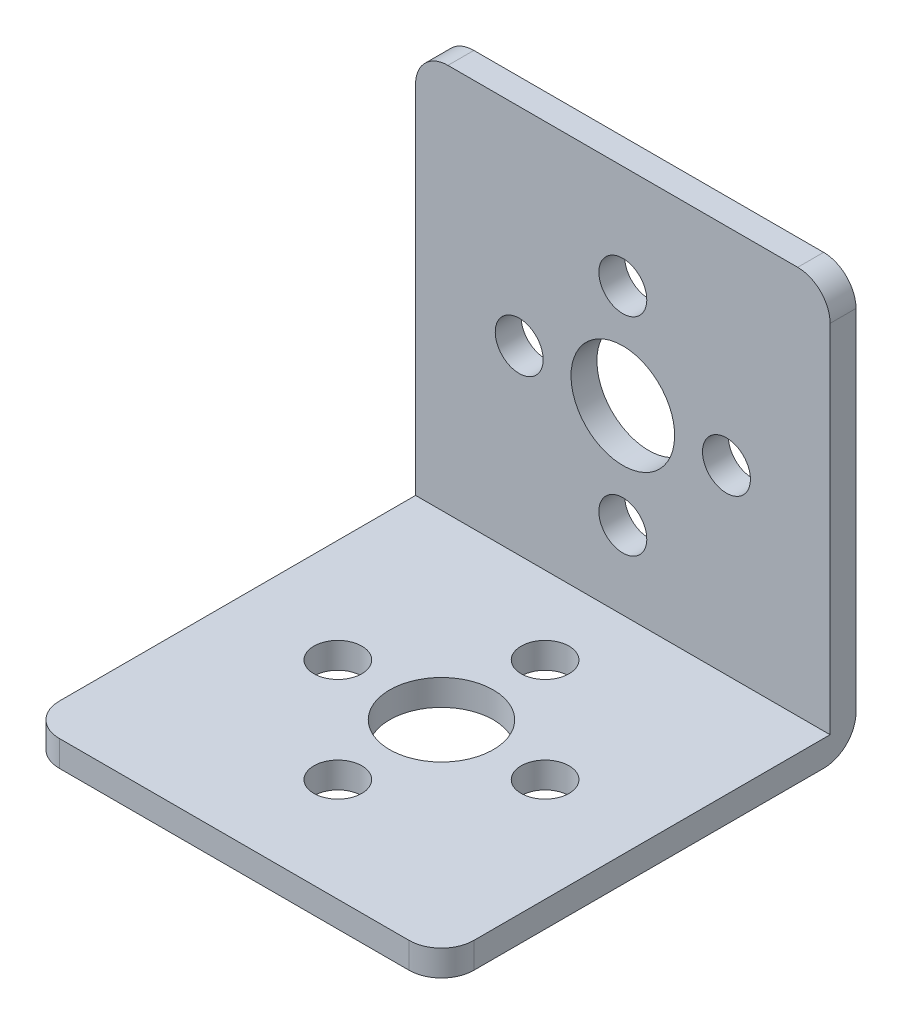
ISO-10303-21;
HEADER;
FILE_DESCRIPTION(('STEP AP214'),'2;1');
FILE_NAME('part.step','',(''),(''),'','','');
FILE_SCHEMA(('AUTOMOTIVE_DESIGN { 1 0 10303 214 1 1 1 1 }'));
ENDSEC;
DATA;
#1=APPLICATION_CONTEXT('core data for automotive mechanical design processes');
#2=APPLICATION_PROTOCOL_DEFINITION('international standard','automotive_design',2000,#1);
#3=PRODUCT_CONTEXT('',#1,'mechanical');
#4=PRODUCT('Part','Part','',(#3));
#5=PRODUCT_RELATED_PRODUCT_CATEGORY('part','',(#4));
#6=PRODUCT_DEFINITION_FORMATION('','',#4);
#7=PRODUCT_DEFINITION_CONTEXT('part definition',#1,'design');
#8=PRODUCT_DEFINITION('design','',#6,#7);
#9=PRODUCT_DEFINITION_SHAPE('','',#8);
#10=(LENGTH_UNIT() NAMED_UNIT(*) SI_UNIT(.MILLI.,.METRE.));
#11=(NAMED_UNIT(*) PLANE_ANGLE_UNIT() SI_UNIT($,.RADIAN.));
#12=(NAMED_UNIT(*) SI_UNIT($,.STERADIAN.) SOLID_ANGLE_UNIT());
#13=UNCERTAINTY_MEASURE_WITH_UNIT(LENGTH_MEASURE(1.E-05),#10,'distance_accuracy_value','');
#14=(GEOMETRIC_REPRESENTATION_CONTEXT(3) GLOBAL_UNCERTAINTY_ASSIGNED_CONTEXT((#13)) GLOBAL_UNIT_ASSIGNED_CONTEXT((#10,
#11,#12)) REPRESENTATION_CONTEXT('',''));
#15=CARTESIAN_POINT('',(0.,0.,0.));
#16=DIRECTION('',(0.,0.,1.));
#17=DIRECTION('',(1.,0.,0.));
#18=AXIS2_PLACEMENT_3D('',#15,#16,#17);
#19=CARTESIAN_POINT('',(16.,16.,16.));
#20=DIRECTION('',(0.,-1.,0.));
#21=DIRECTION('',(0.,0.,-1.));
#22=AXIS2_PLACEMENT_3D('',#19,#20,#21);
#23=PLANE('',#22);
#24=DIRECTION('',(1.,0.,0.));
#25=VECTOR('',#24,1.);
#26=CARTESIAN_POINT('',(-16.,16.,-14.));
#27=LINE('',#26,#25);
#28=CARTESIAN_POINT('',(-13.5,16.,-14.));
#29=VERTEX_POINT('',#28);
#30=CARTESIAN_POINT('',(13.5,16.,-14.));
#31=VERTEX_POINT('',#30);
#32=EDGE_CURVE('E193',#29,#31,#27,.T.);
#33=ORIENTED_EDGE('',*,*,#32,.T.);
#34=DIRECTION('',(0.,0.,-1.));
#35=VECTOR('',#34,1.);
#36=CARTESIAN_POINT('',(13.5,16.,-16.));
#37=LINE('',#36,#35);
#38=CARTESIAN_POINT('',(13.5,16.,-16.));
#39=VERTEX_POINT('',#38);
#40=EDGE_CURVE('E114',#39,#31,#37,.F.);
#41=ORIENTED_EDGE('',*,*,#40,.F.);
#42=DIRECTION('',(1.,0.,0.));
#43=VECTOR('',#42,1.);
#44=CARTESIAN_POINT('',(16.,16.,-16.));
#45=LINE('',#44,#43);
#46=CARTESIAN_POINT('',(-13.5,16.,-16.));
#47=VERTEX_POINT('',#46);
#48=EDGE_CURVE('E103',#39,#47,#45,.F.);
#49=ORIENTED_EDGE('',*,*,#48,.T.);
#50=DIRECTION('',(0.,0.,1.));
#51=VECTOR('',#50,1.);
#52=CARTESIAN_POINT('',(-13.5,16.,16.));
#53=LINE('',#52,#51);
#54=EDGE_CURVE('E94',#29,#47,#53,.F.);
#55=ORIENTED_EDGE('',*,*,#54,.F.);
#56=EDGE_LOOP('',(#33,#41,#49,#55));
#57=FACE_BOUND('',#56,.T.);
#58=ADVANCED_FACE('F15',(#57),#23,.F.);
#59=CARTESIAN_POINT('',(-13.5,13.5,16.));
#60=DIRECTION('',(0.,0.,1.));
#61=DIRECTION('',(1.,0.,0.));
#62=AXIS2_PLACEMENT_3D('',#59,#60,#61);
#63=CYLINDRICAL_SURFACE('',#62,2.5);
#64=ORIENTED_EDGE('',*,*,#54,.T.);
#65=CARTESIAN_POINT('',(-13.5,13.5,-16.));
#66=DIRECTION('',(0.,0.,1.));
#67=DIRECTION('',(1.,0.,0.));
#68=AXIS2_PLACEMENT_3D('',#65,#66,#67);
#69=CIRCLE('',#68,2.5);
#70=CARTESIAN_POINT('',(-16.,13.5,-16.));
#71=VERTEX_POINT('',#70);
#72=EDGE_CURVE('E18',#47,#71,#69,.T.);
#73=ORIENTED_EDGE('',*,*,#72,.T.);
#74=DIRECTION('',(0.,0.,-1.));
#75=VECTOR('',#74,1.);
#76=CARTESIAN_POINT('',(-16.,13.5,-16.));
#77=LINE('',#76,#75);
#78=CARTESIAN_POINT('',(-16.,13.5,-14.));
#79=VERTEX_POINT('',#78);
#80=EDGE_CURVE('E123',#71,#79,#77,.F.);
#81=ORIENTED_EDGE('',*,*,#80,.T.);
#82=CARTESIAN_POINT('',(-13.5,13.5,-14.));
#83=DIRECTION('',(0.,0.,1.));
#84=DIRECTION('',(1.,0.,0.));
#85=AXIS2_PLACEMENT_3D('',#82,#83,#84);
#86=CIRCLE('',#85,2.5);
#87=EDGE_CURVE('E99',#79,#29,#86,.F.);
#88=ORIENTED_EDGE('',*,*,#87,.T.);
#89=EDGE_LOOP('',(#64,#73,#81,#88));
#90=FACE_BOUND('',#89,.T.);
#91=ADVANCED_FACE('F96',(#90),#63,.T.);
#92=CARTESIAN_POINT('',(0.,-8.,16.));
#93=DIRECTION('',(0.,0.,-1.));
#94=DIRECTION('',(0.,1.,0.));
#95=AXIS2_PLACEMENT_3D('',#92,#93,#94);
#96=CYLINDRICAL_SURFACE('',#95,1.85);
#97=CARTESIAN_POINT('',(0.,-7.99999999999999,-14.));
#98=DIRECTION('',(0.,0.,-1.));
#99=DIRECTION('',(0.,1.,0.));
#100=AXIS2_PLACEMENT_3D('',#97,#98,#99);
#101=CIRCLE('',#100,1.85);
#102=CARTESIAN_POINT('',(0.,-6.14999999999999,-14.));
#103=VERTEX_POINT('',#102);
#104=EDGE_CURVE('E185',#103,#103,#101,.F.);
#105=ORIENTED_EDGE('',*,*,#104,.T.);
#106=EDGE_LOOP('',(#105));
#107=FACE_BOUND('',#106,.T.);
#108=CARTESIAN_POINT('',(0.,-7.99999999999999,-16.));
#109=DIRECTION('',(0.,0.,-1.));
#110=DIRECTION('',(0.,1.,0.));
#111=AXIS2_PLACEMENT_3D('',#108,#109,#110);
#112=CIRCLE('',#111,1.85);
#113=CARTESIAN_POINT('',(0.,-6.14999999999999,-16.));
#114=VERTEX_POINT('',#113);
#115=EDGE_CURVE('E121',#114,#114,#112,.T.);
#116=ORIENTED_EDGE('',*,*,#115,.T.);
#117=EDGE_LOOP('',(#116));
#118=FACE_BOUND('',#117,.T.);
#119=ADVANCED_FACE('F212',(#107,#118),#96,.F.);
#120=CARTESIAN_POINT('',(0.,8.,16.));
#121=DIRECTION('',(0.,0.,-1.));
#122=DIRECTION('',(0.,1.,0.));
#123=AXIS2_PLACEMENT_3D('',#120,#121,#122);
#124=CYLINDRICAL_SURFACE('',#123,1.85);
#125=CARTESIAN_POINT('',(0.,8.00000000000001,-14.));
#126=DIRECTION('',(0.,0.,-1.));
#127=DIRECTION('',(0.,1.,0.));
#128=AXIS2_PLACEMENT_3D('',#125,#126,#127);
#129=CIRCLE('',#128,1.85);
#130=CARTESIAN_POINT('',(0.,9.85,-14.));
#131=VERTEX_POINT('',#130);
#132=EDGE_CURVE('E182',#131,#131,#129,.F.);
#133=ORIENTED_EDGE('',*,*,#132,.T.);
#134=EDGE_LOOP('',(#133));
#135=FACE_BOUND('',#134,.T.);
#136=CARTESIAN_POINT('',(0.,8.00000000000001,-16.));
#137=DIRECTION('',(0.,0.,-1.));
#138=DIRECTION('',(0.,1.,0.));
#139=AXIS2_PLACEMENT_3D('',#136,#137,#138);
#140=CIRCLE('',#139,1.85);
#141=CARTESIAN_POINT('',(0.,9.85,-16.));
#142=VERTEX_POINT('',#141);
#143=EDGE_CURVE('E207',#142,#142,#140,.T.);
#144=ORIENTED_EDGE('',*,*,#143,.T.);
#145=EDGE_LOOP('',(#144));
#146=FACE_BOUND('',#145,.T.);
#147=ADVANCED_FACE('F490',(#135,#146),#124,.F.);
#148=CARTESIAN_POINT('',(8.,0.,16.));
#149=DIRECTION('',(0.,0.,-1.));
#150=DIRECTION('',(0.,1.,0.));
#151=AXIS2_PLACEMENT_3D('',#148,#149,#150);
#152=CYLINDRICAL_SURFACE('',#151,1.85);
#153=CARTESIAN_POINT('',(8.,0.,-14.));
#154=DIRECTION('',(0.,0.,-1.));
#155=DIRECTION('',(0.,1.,0.));
#156=AXIS2_PLACEMENT_3D('',#153,#154,#155);
#157=CIRCLE('',#156,1.85);
#158=CARTESIAN_POINT('',(8.,1.85,-14.));
#159=VERTEX_POINT('',#158);
#160=EDGE_CURVE('E179',#159,#159,#157,.F.);
#161=ORIENTED_EDGE('',*,*,#160,.T.);
#162=EDGE_LOOP('',(#161));
#163=FACE_BOUND('',#162,.T.);
#164=CARTESIAN_POINT('',(8.,0.,-16.));
#165=DIRECTION('',(0.,0.,-1.));
#166=DIRECTION('',(0.,1.,0.));
#167=AXIS2_PLACEMENT_3D('',#164,#165,#166);
#168=CIRCLE('',#167,1.85);
#169=CARTESIAN_POINT('',(8.,1.85,-16.));
#170=VERTEX_POINT('',#169);
#171=EDGE_CURVE('E204',#170,#170,#168,.T.);
#172=ORIENTED_EDGE('',*,*,#171,.T.);
#173=EDGE_LOOP('',(#172));
#174=FACE_BOUND('',#173,.T.);
#175=ADVANCED_FACE('F483',(#163,#174),#152,.F.);
#176=CARTESIAN_POINT('',(-8.,0.,16.));
#177=DIRECTION('',(0.,0.,-1.));
#178=DIRECTION('',(0.,1.,0.));
#179=AXIS2_PLACEMENT_3D('',#176,#177,#178);
#180=CYLINDRICAL_SURFACE('',#179,1.85);
#181=CARTESIAN_POINT('',(-8.,0.,-14.));
#182=DIRECTION('',(0.,0.,-1.));
#183=DIRECTION('',(0.,1.,0.));
#184=AXIS2_PLACEMENT_3D('',#181,#182,#183);
#185=CIRCLE('',#184,1.85);
#186=CARTESIAN_POINT('',(-8.,1.85,-14.));
#187=VERTEX_POINT('',#186);
#188=EDGE_CURVE('E176',#187,#187,#185,.F.);
#189=ORIENTED_EDGE('',*,*,#188,.T.);
#190=EDGE_LOOP('',(#189));
#191=FACE_BOUND('',#190,.T.);
#192=CARTESIAN_POINT('',(-8.,0.,-16.));
#193=DIRECTION('',(0.,0.,-1.));
#194=DIRECTION('',(0.,1.,0.));
#195=AXIS2_PLACEMENT_3D('',#192,#193,#194);
#196=CIRCLE('',#195,1.85);
#197=CARTESIAN_POINT('',(-8.,1.85,-16.));
#198=VERTEX_POINT('',#197);
#199=EDGE_CURVE('E201',#198,#198,#196,.T.);
#200=ORIENTED_EDGE('',*,*,#199,.T.);
#201=EDGE_LOOP('',(#200));
#202=FACE_BOUND('',#201,.T.);
#203=ADVANCED_FACE('F477',(#191,#202),#180,.F.);
#204=CARTESIAN_POINT('',(0.,0.,16.));
#205=DIRECTION('',(0.,0.,-1.));
#206=DIRECTION('',(0.,1.,0.));
#207=AXIS2_PLACEMENT_3D('',#204,#205,#206);
#208=CYLINDRICAL_SURFACE('',#207,4.);
#209=CARTESIAN_POINT('',(0.,0.,-14.));
#210=DIRECTION('',(0.,0.,-1.));
#211=DIRECTION('',(0.,1.,0.));
#212=AXIS2_PLACEMENT_3D('',#209,#210,#211);
#213=CIRCLE('',#212,4.);
#214=CARTESIAN_POINT('',(0.,4.,-14.));
#215=VERTEX_POINT('',#214);
#216=EDGE_CURVE('E173',#215,#215,#213,.F.);
#217=ORIENTED_EDGE('',*,*,#216,.T.);
#218=EDGE_LOOP('',(#217));
#219=FACE_BOUND('',#218,.T.);
#220=CARTESIAN_POINT('',(0.,0.,-16.));
#221=DIRECTION('',(0.,0.,-1.));
#222=DIRECTION('',(0.,1.,0.));
#223=AXIS2_PLACEMENT_3D('',#220,#221,#222);
#224=CIRCLE('',#223,4.);
#225=CARTESIAN_POINT('',(0.,4.,-16.));
#226=VERTEX_POINT('',#225);
#227=EDGE_CURVE('E127',#226,#226,#224,.T.);
#228=ORIENTED_EDGE('',*,*,#227,.T.);
#229=EDGE_LOOP('',(#228));
#230=FACE_BOUND('',#229,.T.);
#231=ADVANCED_FACE('F227',(#219,#230),#208,.F.);
#232=CARTESIAN_POINT('',(16.,-13.5,-13.5));
#233=DIRECTION('',(-1.,0.,0.));
#234=DIRECTION('',(0.,0.,1.));
#235=AXIS2_PLACEMENT_3D('',#232,#233,#234);
#236=CYLINDRICAL_SURFACE('',#235,2.5);
#237=DIRECTION('',(1.,0.,0.));
#238=VECTOR('',#237,1.);
#239=CARTESIAN_POINT('',(16.,-13.5,-16.));
#240=LINE('',#239,#238);
#241=CARTESIAN_POINT('',(-16.,-13.5,-16.));
#242=VERTEX_POINT('',#241);
#243=CARTESIAN_POINT('',(16.,-13.5,-16.));
#244=VERTEX_POINT('',#243);
#245=EDGE_CURVE('E112',#242,#244,#240,.T.);
#246=ORIENTED_EDGE('',*,*,#245,.T.);
#247=CARTESIAN_POINT('',(16.,-13.5,-13.5));
#248=DIRECTION('',(-1.,0.,0.));
#249=DIRECTION('',(0.,0.,1.));
#250=AXIS2_PLACEMENT_3D('',#247,#248,#249);
#251=CIRCLE('',#250,2.5);
#252=CARTESIAN_POINT('',(16.,-16.,-13.5));
#253=VERTEX_POINT('',#252);
#254=EDGE_CURVE('E170',#253,#244,#251,.F.);
#255=ORIENTED_EDGE('',*,*,#254,.F.);
#256=DIRECTION('',(1.,0.,0.));
#257=VECTOR('',#256,1.);
#258=CARTESIAN_POINT('',(16.,-16.,-13.5));
#259=LINE('',#258,#257);
#260=CARTESIAN_POINT('',(-16.,-16.,-13.5));
#261=VERTEX_POINT('',#260);
#262=EDGE_CURVE('E198',#253,#261,#259,.F.);
#263=ORIENTED_EDGE('',*,*,#262,.T.);
#264=CARTESIAN_POINT('',(-16.,-13.5,-13.5));
#265=DIRECTION('',(-1.,0.,0.));
#266=DIRECTION('',(0.,0.,1.));
#267=AXIS2_PLACEMENT_3D('',#264,#265,#266);
#268=CIRCLE('',#267,2.5);
#269=EDGE_CURVE('E194',#261,#242,#268,.F.);
#270=ORIENTED_EDGE('',*,*,#269,.T.);
#271=EDGE_LOOP('',(#246,#255,#263,#270));
#272=FACE_BOUND('',#271,.T.);
#273=ADVANCED_FACE('F216',(#272),#236,.T.);
#274=CARTESIAN_POINT('',(16.,16.,-16.));
#275=DIRECTION('',(0.,0.,1.));
#276=DIRECTION('',(0.,-1.,0.));
#277=AXIS2_PLACEMENT_3D('',#274,#275,#276);
#278=PLANE('',#277);
#279=ORIENTED_EDGE('',*,*,#227,.F.);
#280=EDGE_LOOP('',(#279));
#281=FACE_BOUND('',#280,.T.);
#282=ORIENTED_EDGE('',*,*,#199,.F.);
#283=EDGE_LOOP('',(#282));
#284=FACE_BOUND('',#283,.T.);
#285=ORIENTED_EDGE('',*,*,#171,.F.);
#286=EDGE_LOOP('',(#285));
#287=FACE_BOUND('',#286,.T.);
#288=ORIENTED_EDGE('',*,*,#143,.F.);
#289=EDGE_LOOP('',(#288));
#290=FACE_BOUND('',#289,.T.);
#291=ORIENTED_EDGE('',*,*,#115,.F.);
#292=EDGE_LOOP('',(#291));
#293=FACE_BOUND('',#292,.T.);
#294=DIRECTION('',(0.,1.,0.));
#295=VECTOR('',#294,1.);
#296=CARTESIAN_POINT('',(-16.,-16.,-16.));
#297=LINE('',#296,#295);
#298=EDGE_CURVE('E111',#242,#71,#297,.T.);
#299=ORIENTED_EDGE('',*,*,#298,.T.);
#300=ORIENTED_EDGE('',*,*,#72,.F.);
#301=ORIENTED_EDGE('',*,*,#48,.F.);
#302=CARTESIAN_POINT('',(13.5,13.5,-16.));
#303=DIRECTION('',(0.,0.,-1.));
#304=DIRECTION('',(-1.,0.,0.));
#305=AXIS2_PLACEMENT_3D('',#302,#303,#304);
#306=CIRCLE('',#305,2.5);
#307=CARTESIAN_POINT('',(16.,13.5,-16.));
#308=VERTEX_POINT('',#307);
#309=EDGE_CURVE('E126',#308,#39,#306,.F.);
#310=ORIENTED_EDGE('',*,*,#309,.F.);
#311=DIRECTION('',(0.,1.,0.));
#312=VECTOR('',#311,1.);
#313=CARTESIAN_POINT('',(16.,-16.,-16.));
#314=LINE('',#313,#312);
#315=EDGE_CURVE('E172',#244,#308,#314,.T.);
#316=ORIENTED_EDGE('',*,*,#315,.F.);
#317=ORIENTED_EDGE('',*,*,#245,.F.);
#318=EDGE_LOOP('',(#299,#300,#301,#310,#316,#317));
#319=FACE_BOUND('',#318,.T.);
#320=ADVANCED_FACE('F107',(#281,#284,#287,#290,#293,#319),#278,.F.);
#321=CARTESIAN_POINT('',(13.5,13.5,-16.));
#322=DIRECTION('',(0.,0.,-1.));
#323=DIRECTION('',(-1.,0.,0.));
#324=AXIS2_PLACEMENT_3D('',#321,#322,#323);
#325=CYLINDRICAL_SURFACE('',#324,2.5);
#326=DIRECTION('',(0.,0.,-1.));
#327=VECTOR('',#326,1.);
#328=CARTESIAN_POINT('',(16.,13.5,-16.));
#329=LINE('',#328,#327);
#330=CARTESIAN_POINT('',(16.,13.5,-14.));
#331=VERTEX_POINT('',#330);
#332=EDGE_CURVE('E118',#308,#331,#329,.F.);
#333=ORIENTED_EDGE('',*,*,#332,.F.);
#334=ORIENTED_EDGE('',*,*,#309,.T.);
#335=ORIENTED_EDGE('',*,*,#40,.T.);
#336=CARTESIAN_POINT('',(13.5,13.5,-14.));
#337=DIRECTION('',(0.,0.,-1.));
#338=DIRECTION('',(-1.,0.,0.));
#339=AXIS2_PLACEMENT_3D('',#336,#337,#338);
#340=CIRCLE('',#339,2.5);
#341=EDGE_CURVE('E190',#31,#331,#340,.T.);
#342=ORIENTED_EDGE('',*,*,#341,.T.);
#343=EDGE_LOOP('',(#333,#334,#335,#342));
#344=FACE_BOUND('',#343,.T.);
#345=ADVANCED_FACE('F215',(#344),#325,.T.);
#346=CARTESIAN_POINT('',(16.,-16.,16.));
#347=DIRECTION('',(0.,1.,0.));
#348=DIRECTION('',(0.,0.,1.));
#349=AXIS2_PLACEMENT_3D('',#346,#347,#348);
#350=PLANE('',#349);
#351=CARTESIAN_POINT('',(0.,-16.,0.));
#352=DIRECTION('',(0.,-1.,0.));
#353=DIRECTION('',(0.,0.,-1.));
#354=AXIS2_PLACEMENT_3D('',#351,#352,#353);
#355=CIRCLE('',#354,4.);
#356=CARTESIAN_POINT('',(0.,-16.,-4.));
#357=VERTEX_POINT('',#356);
#358=EDGE_CURVE('E147',#357,#357,#355,.F.);
#359=ORIENTED_EDGE('',*,*,#358,.T.);
#360=EDGE_LOOP('',(#359));
#361=FACE_BOUND('',#360,.T.);
#362=CARTESIAN_POINT('',(8.,-16.,0.));
#363=DIRECTION('',(0.,-1.,0.));
#364=DIRECTION('',(0.,0.,-1.));
#365=AXIS2_PLACEMENT_3D('',#362,#363,#364);
#366=CIRCLE('',#365,1.85);
#367=CARTESIAN_POINT('',(8.,-16.,-1.85));
#368=VERTEX_POINT('',#367);
#369=EDGE_CURVE('E151',#368,#368,#366,.F.);
#370=ORIENTED_EDGE('',*,*,#369,.T.);
#371=EDGE_LOOP('',(#370));
#372=FACE_BOUND('',#371,.T.);
#373=CARTESIAN_POINT('',(-8.,-16.,0.));
#374=DIRECTION('',(0.,-1.,0.));
#375=DIRECTION('',(0.,0.,-1.));
#376=AXIS2_PLACEMENT_3D('',#373,#374,#375);
#377=CIRCLE('',#376,1.85);
#378=CARTESIAN_POINT('',(-8.,-16.,-1.85));
#379=VERTEX_POINT('',#378);
#380=EDGE_CURVE('E154',#379,#379,#377,.F.);
#381=ORIENTED_EDGE('',*,*,#380,.T.);
#382=EDGE_LOOP('',(#381));
#383=FACE_BOUND('',#382,.T.);
#384=CARTESIAN_POINT('',(0.,-16.,8.));
#385=DIRECTION('',(0.,-1.,0.));
#386=DIRECTION('',(0.,0.,-1.));
#387=AXIS2_PLACEMENT_3D('',#384,#385,#386);
#388=CIRCLE('',#387,1.85);
#389=CARTESIAN_POINT('',(0.,-16.,6.15));
#390=VERTEX_POINT('',#389);
#391=EDGE_CURVE('E157',#390,#390,#388,.F.);
#392=ORIENTED_EDGE('',*,*,#391,.T.);
#393=EDGE_LOOP('',(#392));
#394=FACE_BOUND('',#393,.T.);
#395=CARTESIAN_POINT('',(0.,-16.,-8.));
#396=DIRECTION('',(0.,-1.,0.));
#397=DIRECTION('',(0.,0.,-1.));
#398=AXIS2_PLACEMENT_3D('',#395,#396,#397);
#399=CIRCLE('',#398,1.85);
#400=CARTESIAN_POINT('',(0.,-16.,-9.85));
#401=VERTEX_POINT('',#400);
#402=EDGE_CURVE('E160',#401,#401,#399,.F.);
#403=ORIENTED_EDGE('',*,*,#402,.T.);
#404=EDGE_LOOP('',(#403));
#405=FACE_BOUND('',#404,.T.);
#406=DIRECTION('',(0.,0.,-1.));
#407=VECTOR('',#406,1.);
#408=CARTESIAN_POINT('',(16.,-16.,-16.));
#409=LINE('',#408,#407);
#410=CARTESIAN_POINT('',(16.,-16.,13.5));
#411=VERTEX_POINT('',#410);
#412=EDGE_CURVE('E169',#411,#253,#409,.T.);
#413=ORIENTED_EDGE('',*,*,#412,.F.);
#414=CARTESIAN_POINT('',(13.5,-16.,13.5));
#415=DIRECTION('',(0.,1.,0.));
#416=DIRECTION('',(0.,0.,1.));
#417=AXIS2_PLACEMENT_3D('',#414,#415,#416);
#418=CIRCLE('',#417,2.5);
#419=CARTESIAN_POINT('',(13.5,-16.,16.));
#420=VERTEX_POINT('',#419);
#421=EDGE_CURVE('E166',#420,#411,#418,.T.);
#422=ORIENTED_EDGE('',*,*,#421,.F.);
#423=DIRECTION('',(-1.,0.,0.));
#424=VECTOR('',#423,1.);
#425=CARTESIAN_POINT('',(16.,-16.,16.));
#426=LINE('',#425,#424);
#427=CARTESIAN_POINT('',(-13.5,-16.,16.));
#428=VERTEX_POINT('',#427);
#429=EDGE_CURVE('E314',#420,#428,#426,.T.);
#430=ORIENTED_EDGE('',*,*,#429,.T.);
#431=CARTESIAN_POINT('',(-13.5,-16.,13.5));
#432=DIRECTION('',(0.,-1.,0.));
#433=DIRECTION('',(0.,0.,-1.));
#434=AXIS2_PLACEMENT_3D('',#431,#432,#433);
#435=CIRCLE('',#434,2.5);
#436=CARTESIAN_POINT('',(-16.,-16.,13.5));
#437=VERTEX_POINT('',#436);
#438=EDGE_CURVE('E163',#437,#428,#435,.F.);
#439=ORIENTED_EDGE('',*,*,#438,.F.);
#440=DIRECTION('',(0.,0.,-1.));
#441=VECTOR('',#440,1.);
#442=CARTESIAN_POINT('',(-16.,-16.,-16.));
#443=LINE('',#442,#441);
#444=EDGE_CURVE('E125',#437,#261,#443,.T.);
#445=ORIENTED_EDGE('',*,*,#444,.T.);
#446=ORIENTED_EDGE('',*,*,#262,.F.);
#447=EDGE_LOOP('',(#413,#422,#430,#439,#445,#446));
#448=FACE_BOUND('',#447,.T.);
#449=ADVANCED_FACE('F224',(#361,#372,#383,#394,#405,#448),#350,.F.);
#450=CARTESIAN_POINT('',(-16.,-16.,-16.));
#451=DIRECTION('',(1.,0.,0.));
#452=DIRECTION('',(0.,0.,-1.));
#453=AXIS2_PLACEMENT_3D('',#450,#451,#452);
#454=PLANE('',#453);
#455=ORIENTED_EDGE('',*,*,#444,.F.);
#456=DIRECTION('',(0.,-1.,0.));
#457=VECTOR('',#456,1.);
#458=CARTESIAN_POINT('',(-16.,16.,13.5));
#459=LINE('',#458,#457);
#460=CARTESIAN_POINT('',(-16.,-14.,13.5));
#461=VERTEX_POINT('',#460);
#462=EDGE_CURVE('E165',#461,#437,#459,.T.);
#463=ORIENTED_EDGE('',*,*,#462,.F.);
#464=DIRECTION('',(0.,0.,-1.));
#465=VECTOR('',#464,1.);
#466=CARTESIAN_POINT('',(-16.,-14.,16.));
#467=LINE('',#466,#465);
#468=CARTESIAN_POINT('',(-16.,-14.,-14.));
#469=VERTEX_POINT('',#468);
#470=EDGE_CURVE('E150',#461,#469,#467,.T.);
#471=ORIENTED_EDGE('',*,*,#470,.T.);
#472=DIRECTION('',(0.,1.,0.));
#473=VECTOR('',#472,1.);
#474=CARTESIAN_POINT('',(-16.,16.,-14.));
#475=LINE('',#474,#473);
#476=EDGE_CURVE('E189',#469,#79,#475,.T.);
#477=ORIENTED_EDGE('',*,*,#476,.T.);
#478=ORIENTED_EDGE('',*,*,#80,.F.);
#479=ORIENTED_EDGE('',*,*,#298,.F.);
#480=ORIENTED_EDGE('',*,*,#269,.F.);
#481=EDGE_LOOP('',(#455,#463,#471,#477,#478,#479,#480));
#482=FACE_BOUND('',#481,.T.);
#483=ADVANCED_FACE('F279',(#482),#454,.F.);
#484=CARTESIAN_POINT('',(-16.,16.,-14.));
#485=DIRECTION('',(0.,0.,-1.));
#486=DIRECTION('',(0.,1.,0.));
#487=AXIS2_PLACEMENT_3D('',#484,#485,#486);
#488=PLANE('',#487);
#489=ORIENTED_EDGE('',*,*,#216,.F.);
#490=EDGE_LOOP('',(#489));
#491=FACE_BOUND('',#490,.T.);
#492=ORIENTED_EDGE('',*,*,#188,.F.);
#493=EDGE_LOOP('',(#492));
#494=FACE_BOUND('',#493,.T.);
#495=ORIENTED_EDGE('',*,*,#160,.F.);
#496=EDGE_LOOP('',(#495));
#497=FACE_BOUND('',#496,.T.);
#498=ORIENTED_EDGE('',*,*,#132,.F.);
#499=EDGE_LOOP('',(#498));
#500=FACE_BOUND('',#499,.T.);
#501=ORIENTED_EDGE('',*,*,#104,.F.);
#502=EDGE_LOOP('',(#501));
#503=FACE_BOUND('',#502,.T.);
#504=ORIENTED_EDGE('',*,*,#476,.F.);
#505=DIRECTION('',(1.,0.,0.));
#506=VECTOR('',#505,1.);
#507=CARTESIAN_POINT('',(-16.,-14.,-14.));
#508=LINE('',#507,#506);
#509=CARTESIAN_POINT('',(16.,-14.,-14.));
#510=VERTEX_POINT('',#509);
#511=EDGE_CURVE('E322',#469,#510,#508,.T.);
#512=ORIENTED_EDGE('',*,*,#511,.T.);
#513=DIRECTION('',(0.,1.,0.));
#514=VECTOR('',#513,1.);
#515=CARTESIAN_POINT('',(16.,-16.,-14.));
#516=LINE('',#515,#514);
#517=EDGE_CURVE('E305',#331,#510,#516,.F.);
#518=ORIENTED_EDGE('',*,*,#517,.F.);
#519=ORIENTED_EDGE('',*,*,#341,.F.);
#520=ORIENTED_EDGE('',*,*,#32,.F.);
#521=ORIENTED_EDGE('',*,*,#87,.F.);
#522=EDGE_LOOP('',(#504,#512,#518,#519,#520,#521));
#523=FACE_BOUND('',#522,.T.);
#524=ADVANCED_FACE('F275',(#491,#494,#497,#500,#503,#523),#488,.F.);
#525=CARTESIAN_POINT('',(16.,-16.,-16.));
#526=DIRECTION('',(1.,0.,0.));
#527=DIRECTION('',(0.,0.,-1.));
#528=AXIS2_PLACEMENT_3D('',#525,#526,#527);
#529=PLANE('',#528);
#530=DIRECTION('',(0.,1.,0.));
#531=VECTOR('',#530,1.);
#532=CARTESIAN_POINT('',(16.,-16.,13.5));
#533=LINE('',#532,#531);
#534=CARTESIAN_POINT('',(16.,-14.,13.5));
#535=VERTEX_POINT('',#534);
#536=EDGE_CURVE('E168',#411,#535,#533,.T.);
#537=ORIENTED_EDGE('',*,*,#536,.F.);
#538=ORIENTED_EDGE('',*,*,#412,.T.);
#539=ORIENTED_EDGE('',*,*,#254,.T.);
#540=ORIENTED_EDGE('',*,*,#315,.T.);
#541=ORIENTED_EDGE('',*,*,#332,.T.);
#542=ORIENTED_EDGE('',*,*,#517,.T.);
#543=DIRECTION('',(0.,0.,-1.));
#544=VECTOR('',#543,1.);
#545=CARTESIAN_POINT('',(16.,-14.,16.));
#546=LINE('',#545,#544);
#547=EDGE_CURVE('E146',#510,#535,#546,.F.);
#548=ORIENTED_EDGE('',*,*,#547,.T.);
#549=EDGE_LOOP('',(#537,#538,#539,#540,#541,#542,#548));
#550=FACE_BOUND('',#549,.T.);
#551=ADVANCED_FACE('F271',(#550),#529,.T.);
#552=CARTESIAN_POINT('',(13.5,-16.,13.5));
#553=DIRECTION('',(0.,1.,0.));
#554=DIRECTION('',(0.,0.,1.));
#555=AXIS2_PLACEMENT_3D('',#552,#553,#554);
#556=CYLINDRICAL_SURFACE('',#555,2.5);
#557=ORIENTED_EDGE('',*,*,#536,.T.);
#558=CARTESIAN_POINT('',(13.5,-14.,13.5));
#559=DIRECTION('',(0.,1.,0.));
#560=DIRECTION('',(0.,0.,1.));
#561=AXIS2_PLACEMENT_3D('',#558,#559,#560);
#562=CIRCLE('',#561,2.5);
#563=CARTESIAN_POINT('',(13.5,-14.,16.));
#564=VERTEX_POINT('',#563);
#565=EDGE_CURVE('E143',#535,#564,#562,.F.);
#566=ORIENTED_EDGE('',*,*,#565,.T.);
#567=DIRECTION('',(0.,1.,0.));
#568=VECTOR('',#567,1.);
#569=CARTESIAN_POINT('',(13.5,16.,16.));
#570=LINE('',#569,#568);
#571=EDGE_CURVE('E311',#564,#420,#570,.F.);
#572=ORIENTED_EDGE('',*,*,#571,.T.);
#573=ORIENTED_EDGE('',*,*,#421,.T.);
#574=EDGE_LOOP('',(#557,#566,#572,#573));
#575=FACE_BOUND('',#574,.T.);
#576=ADVANCED_FACE('F267',(#575),#556,.T.);
#577=CARTESIAN_POINT('',(16.,16.,16.));
#578=DIRECTION('',(0.,0.,-1.));
#579=DIRECTION('',(-1.,0.,0.));
#580=AXIS2_PLACEMENT_3D('',#577,#578,#579);
#581=PLANE('',#580);
#582=ORIENTED_EDGE('',*,*,#429,.F.);
#583=ORIENTED_EDGE('',*,*,#571,.F.);
#584=DIRECTION('',(1.,0.,0.));
#585=VECTOR('',#584,1.);
#586=CARTESIAN_POINT('',(-16.,-14.,16.));
#587=LINE('',#586,#585);
#588=CARTESIAN_POINT('',(-13.5,-14.,16.));
#589=VERTEX_POINT('',#588);
#590=EDGE_CURVE('E142',#564,#589,#587,.F.);
#591=ORIENTED_EDGE('',*,*,#590,.T.);
#592=DIRECTION('',(0.,-1.,0.));
#593=VECTOR('',#592,1.);
#594=CARTESIAN_POINT('',(-13.5,16.,16.));
#595=LINE('',#594,#593);
#596=EDGE_CURVE('E33',#428,#589,#595,.F.);
#597=ORIENTED_EDGE('',*,*,#596,.F.);
#598=EDGE_LOOP('',(#582,#583,#591,#597));
#599=FACE_BOUND('',#598,.T.);
#600=ADVANCED_FACE('F264',(#599),#581,.F.);
#601=CARTESIAN_POINT('',(-13.5,16.,13.5));
#602=DIRECTION('',(0.,-1.,0.));
#603=DIRECTION('',(0.,0.,-1.));
#604=AXIS2_PLACEMENT_3D('',#601,#602,#603);
#605=CYLINDRICAL_SURFACE('',#604,2.5);
#606=ORIENTED_EDGE('',*,*,#596,.T.);
#607=CARTESIAN_POINT('',(-13.5,-14.,13.5));
#608=DIRECTION('',(0.,-1.,0.));
#609=DIRECTION('',(0.,0.,-1.));
#610=AXIS2_PLACEMENT_3D('',#607,#608,#609);
#611=CIRCLE('',#610,2.5);
#612=EDGE_CURVE('E140',#589,#461,#611,.T.);
#613=ORIENTED_EDGE('',*,*,#612,.T.);
#614=ORIENTED_EDGE('',*,*,#462,.T.);
#615=ORIENTED_EDGE('',*,*,#438,.T.);
#616=EDGE_LOOP('',(#606,#613,#614,#615));
#617=FACE_BOUND('',#616,.T.);
#618=ADVANCED_FACE('F260',(#617),#605,.T.);
#619=CARTESIAN_POINT('',(0.,16.,-8.));
#620=DIRECTION('',(0.,-1.,0.));
#621=DIRECTION('',(0.,0.,-1.));
#622=AXIS2_PLACEMENT_3D('',#619,#620,#621);
#623=CYLINDRICAL_SURFACE('',#622,1.85);
#624=CARTESIAN_POINT('',(0.,-14.,-8.));
#625=DIRECTION('',(0.,-1.,0.));
#626=DIRECTION('',(0.,0.,-1.));
#627=AXIS2_PLACEMENT_3D('',#624,#625,#626);
#628=CIRCLE('',#627,1.85);
#629=CARTESIAN_POINT('',(0.,-14.,-9.85));
#630=VERTEX_POINT('',#629);
#631=EDGE_CURVE('E137',#630,#630,#628,.F.);
#632=ORIENTED_EDGE('',*,*,#631,.T.);
#633=EDGE_LOOP('',(#632));
#634=FACE_BOUND('',#633,.T.);
#635=ORIENTED_EDGE('',*,*,#402,.F.);
#636=EDGE_LOOP('',(#635));
#637=FACE_BOUND('',#636,.T.);
#638=ADVANCED_FACE('F256',(#634,#637),#623,.F.);
#639=CARTESIAN_POINT('',(0.,16.,8.));
#640=DIRECTION('',(0.,-1.,0.));
#641=DIRECTION('',(0.,0.,-1.));
#642=AXIS2_PLACEMENT_3D('',#639,#640,#641);
#643=CYLINDRICAL_SURFACE('',#642,1.85);
#644=CARTESIAN_POINT('',(0.,-14.,8.));
#645=DIRECTION('',(0.,-1.,0.));
#646=DIRECTION('',(0.,0.,-1.));
#647=AXIS2_PLACEMENT_3D('',#644,#645,#646);
#648=CIRCLE('',#647,1.85);
#649=CARTESIAN_POINT('',(0.,-14.,6.15));
#650=VERTEX_POINT('',#649);
#651=EDGE_CURVE('E134',#650,#650,#648,.F.);
#652=ORIENTED_EDGE('',*,*,#651,.T.);
#653=EDGE_LOOP('',(#652));
#654=FACE_BOUND('',#653,.T.);
#655=ORIENTED_EDGE('',*,*,#391,.F.);
#656=EDGE_LOOP('',(#655));
#657=FACE_BOUND('',#656,.T.);
#658=ADVANCED_FACE('F252',(#654,#657),#643,.F.);
#659=CARTESIAN_POINT('',(-8.,16.,0.));
#660=DIRECTION('',(0.,-1.,0.));
#661=DIRECTION('',(0.,0.,-1.));
#662=AXIS2_PLACEMENT_3D('',#659,#660,#661);
#663=CYLINDRICAL_SURFACE('',#662,1.85);
#664=CARTESIAN_POINT('',(-8.,-14.,0.));
#665=DIRECTION('',(0.,-1.,0.));
#666=DIRECTION('',(0.,0.,-1.));
#667=AXIS2_PLACEMENT_3D('',#664,#665,#666);
#668=CIRCLE('',#667,1.85);
#669=CARTESIAN_POINT('',(-8.,-14.,-1.85));
#670=VERTEX_POINT('',#669);
#671=EDGE_CURVE('E131',#670,#670,#668,.F.);
#672=ORIENTED_EDGE('',*,*,#671,.T.);
#673=EDGE_LOOP('',(#672));
#674=FACE_BOUND('',#673,.T.);
#675=ORIENTED_EDGE('',*,*,#380,.F.);
#676=EDGE_LOOP('',(#675));
#677=FACE_BOUND('',#676,.T.);
#678=ADVANCED_FACE('F248',(#674,#677),#663,.F.);
#679=CARTESIAN_POINT('',(8.,16.,0.));
#680=DIRECTION('',(0.,-1.,0.));
#681=DIRECTION('',(0.,0.,-1.));
#682=AXIS2_PLACEMENT_3D('',#679,#680,#681);
#683=CYLINDRICAL_SURFACE('',#682,1.85);
#684=CARTESIAN_POINT('',(8.,-14.,0.));
#685=DIRECTION('',(0.,-1.,0.));
#686=DIRECTION('',(0.,0.,-1.));
#687=AXIS2_PLACEMENT_3D('',#684,#685,#686);
#688=CIRCLE('',#687,1.85);
#689=CARTESIAN_POINT('',(8.,-14.,-1.85));
#690=VERTEX_POINT('',#689);
#691=EDGE_CURVE('E24',#690,#690,#688,.F.);
#692=ORIENTED_EDGE('',*,*,#691,.T.);
#693=EDGE_LOOP('',(#692));
#694=FACE_BOUND('',#693,.T.);
#695=ORIENTED_EDGE('',*,*,#369,.F.);
#696=EDGE_LOOP('',(#695));
#697=FACE_BOUND('',#696,.T.);
#698=ADVANCED_FACE('F240',(#694,#697),#683,.F.);
#699=CARTESIAN_POINT('',(0.,16.,0.));
#700=DIRECTION('',(0.,-1.,0.));
#701=DIRECTION('',(0.,0.,-1.));
#702=AXIS2_PLACEMENT_3D('',#699,#700,#701);
#703=CYLINDRICAL_SURFACE('',#702,4.);
#704=CARTESIAN_POINT('',(0.,-14.,0.));
#705=DIRECTION('',(0.,-1.,0.));
#706=DIRECTION('',(0.,0.,-1.));
#707=AXIS2_PLACEMENT_3D('',#704,#705,#706);
#708=CIRCLE('',#707,4.);
#709=CARTESIAN_POINT('',(0.,-14.,-4.));
#710=VERTEX_POINT('',#709);
#711=EDGE_CURVE('E10',#710,#710,#708,.F.);
#712=ORIENTED_EDGE('',*,*,#711,.T.);
#713=EDGE_LOOP('',(#712));
#714=FACE_BOUND('',#713,.T.);
#715=ORIENTED_EDGE('',*,*,#358,.F.);
#716=EDGE_LOOP('',(#715));
#717=FACE_BOUND('',#716,.T.);
#718=ADVANCED_FACE('F234',(#714,#717),#703,.F.);
#719=CARTESIAN_POINT('',(-16.,-14.,16.));
#720=DIRECTION('',(0.,-1.,0.));
#721=DIRECTION('',(0.,0.,-1.));
#722=AXIS2_PLACEMENT_3D('',#719,#720,#721);
#723=PLANE('',#722);
#724=ORIENTED_EDGE('',*,*,#711,.F.);
#725=EDGE_LOOP('',(#724));
#726=FACE_BOUND('',#725,.T.);
#727=ORIENTED_EDGE('',*,*,#691,.F.);
#728=EDGE_LOOP('',(#727));
#729=FACE_BOUND('',#728,.T.);
#730=ORIENTED_EDGE('',*,*,#671,.F.);
#731=EDGE_LOOP('',(#730));
#732=FACE_BOUND('',#731,.T.);
#733=ORIENTED_EDGE('',*,*,#651,.F.);
#734=EDGE_LOOP('',(#733));
#735=FACE_BOUND('',#734,.T.);
#736=ORIENTED_EDGE('',*,*,#631,.F.);
#737=EDGE_LOOP('',(#736));
#738=FACE_BOUND('',#737,.T.);
#739=ORIENTED_EDGE('',*,*,#590,.F.);
#740=ORIENTED_EDGE('',*,*,#565,.F.);
#741=ORIENTED_EDGE('',*,*,#547,.F.);
#742=ORIENTED_EDGE('',*,*,#511,.F.);
#743=ORIENTED_EDGE('',*,*,#470,.F.);
#744=ORIENTED_EDGE('',*,*,#612,.F.);
#745=EDGE_LOOP('',(#739,#740,#741,#742,#743,#744));
#746=FACE_BOUND('',#745,.T.);
#747=ADVANCED_FACE('F232',(#726,#729,#732,#735,#738,#746),#723,.F.);
#748=CLOSED_SHELL('',(#58,#91,#119,#147,#175,#203,#231,#273,#320,#345,#449,#483,#524,#551,#576,
#600,#618,#638,#658,#678,#698,#718,#747));
#749=MANIFOLD_SOLID_BREP('B1',#748);
#750=ADVANCED_BREP_SHAPE_REPRESENTATION('',(#18,#749),#14);
#751=SHAPE_DEFINITION_REPRESENTATION(#9,#750);
ENDSEC;
END-ISO-10303-21;
